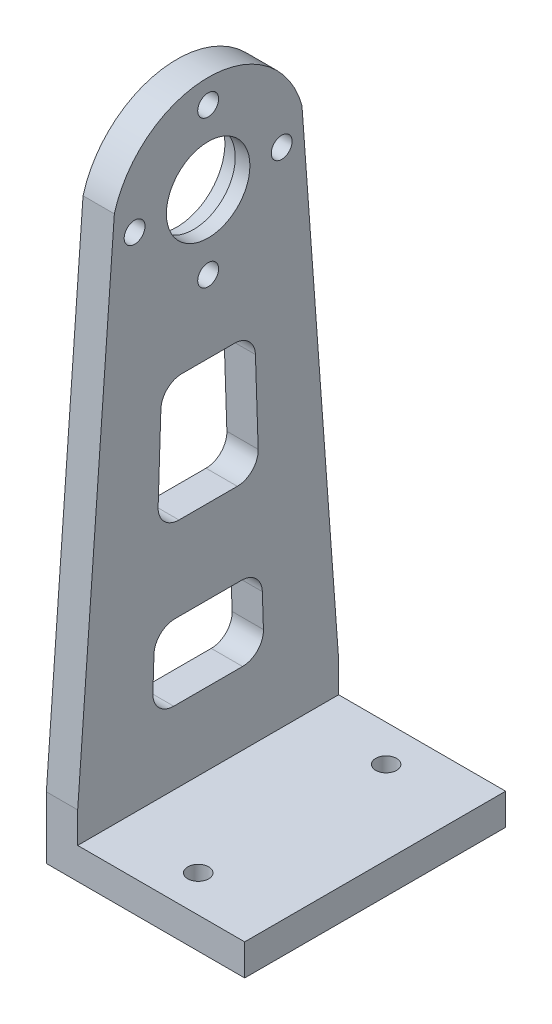
ISO-10303-21;
HEADER;
FILE_DESCRIPTION(('STEP AP214'),'2;1');
FILE_NAME('part.step','',(''),(''),'','','');
FILE_SCHEMA(('AUTOMOTIVE_DESIGN { 1 0 10303 214 1 1 1 1 }'));
ENDSEC;
DATA;
#1=APPLICATION_CONTEXT('core data for automotive mechanical design processes');
#2=APPLICATION_PROTOCOL_DEFINITION('international standard','automotive_design',2000,#1);
#3=PRODUCT_CONTEXT('',#1,'mechanical');
#4=PRODUCT('Part','Part','',(#3));
#5=PRODUCT_RELATED_PRODUCT_CATEGORY('part','',(#4));
#6=PRODUCT_DEFINITION_FORMATION('','',#4);
#7=PRODUCT_DEFINITION_CONTEXT('part definition',#1,'design');
#8=PRODUCT_DEFINITION('design','',#6,#7);
#9=PRODUCT_DEFINITION_SHAPE('','',#8);
#10=(LENGTH_UNIT() NAMED_UNIT(*) SI_UNIT(.MILLI.,.METRE.));
#11=(NAMED_UNIT(*) PLANE_ANGLE_UNIT() SI_UNIT($,.RADIAN.));
#12=(NAMED_UNIT(*) SI_UNIT($,.STERADIAN.) SOLID_ANGLE_UNIT());
#13=UNCERTAINTY_MEASURE_WITH_UNIT(LENGTH_MEASURE(1.E-05),#10,'distance_accuracy_value','');
#14=(GEOMETRIC_REPRESENTATION_CONTEXT(3) GLOBAL_UNCERTAINTY_ASSIGNED_CONTEXT((#13)) GLOBAL_UNIT_ASSIGNED_CONTEXT((#10,
#11,#12)) REPRESENTATION_CONTEXT('',''));
#15=CARTESIAN_POINT('',(0.,0.,0.));
#16=DIRECTION('',(0.,0.,1.));
#17=DIRECTION('',(1.,0.,0.));
#18=AXIS2_PLACEMENT_3D('',#15,#16,#17);
#19=CARTESIAN_POINT('',(15.5,-52.,0.));
#20=DIRECTION('',(-1.,0.,0.));
#21=DIRECTION('',(0.,0.,1.));
#22=AXIS2_PLACEMENT_3D('',#19,#20,#21);
#23=CYLINDRICAL_SURFACE('',#22,4.);
#24=CARTESIAN_POINT('',(16.5,-52.,0.));
#25=DIRECTION('',(-1.,0.,0.));
#26=DIRECTION('',(0.,0.,-1.));
#27=AXIS2_PLACEMENT_3D('',#24,#25,#26);
#28=CIRCLE('',#27,4.);
#29=CARTESIAN_POINT('',(16.5,-52.,-4.));
#30=VERTEX_POINT('',#29);
#31=EDGE_CURVE('E49',#30,#30,#28,.T.);
#32=ORIENTED_EDGE('',*,*,#31,.F.);
#33=EDGE_LOOP('',(#32));
#34=FACE_BOUND('',#33,.T.);
#35=CARTESIAN_POINT('',(15.1,-52.,0.));
#36=DIRECTION('',(-1.,0.,0.));
#37=DIRECTION('',(0.,0.,1.));
#38=AXIS2_PLACEMENT_3D('',#35,#36,#37);
#39=CIRCLE('',#38,4.);
#40=CARTESIAN_POINT('',(15.1,-52.,4.));
#41=VERTEX_POINT('',#40);
#42=EDGE_CURVE('E43',#41,#41,#39,.F.);
#43=ORIENTED_EDGE('',*,*,#42,.F.);
#44=EDGE_LOOP('',(#43));
#45=FACE_BOUND('',#44,.T.);
#46=ADVANCED_FACE('F40',(#34,#45),#23,.F.);
#47=CARTESIAN_POINT('',(16.5,-100.7,-12.5));
#48=DIRECTION('',(1.,0.,0.));
#49=DIRECTION('',(0.,-1.,0.));
#50=AXIS2_PLACEMENT_3D('',#47,#48,#49);
#51=PLANE('',#50);
#52=CARTESIAN_POINT('',(16.5,-59.0452123011725,1.54223501579341E-13));
#53=DIRECTION('',(-1.,0.,0.));
#54=DIRECTION('',(0.,0.,1.));
#55=AXIS2_PLACEMENT_3D('',#52,#53,#54);
#56=CIRCLE('',#55,1.);
#57=CARTESIAN_POINT('',(16.5,-59.0452123011725,1.00000000000015));
#58=VERTEX_POINT('',#57);
#59=EDGE_CURVE('E522',#58,#58,#56,.T.);
#60=ORIENTED_EDGE('',*,*,#59,.T.);
#61=EDGE_LOOP('',(#60));
#62=FACE_BOUND('',#61,.T.);
#63=CARTESIAN_POINT('',(16.5,-52.,7.04521230117253));
#64=DIRECTION('',(-1.,0.,0.));
#65=DIRECTION('',(0.,0.,1.));
#66=AXIS2_PLACEMENT_3D('',#63,#64,#65);
#67=CIRCLE('',#66,1.00000000000001);
#68=CARTESIAN_POINT('',(16.5,-52.,8.04521230117253));
#69=VERTEX_POINT('',#68);
#70=EDGE_CURVE('E528',#69,#69,#67,.T.);
#71=ORIENTED_EDGE('',*,*,#70,.T.);
#72=EDGE_LOOP('',(#71));
#73=FACE_BOUND('',#72,.T.);
#74=CARTESIAN_POINT('',(16.5,-52.0000000000001,-7.04521230117231));
#75=DIRECTION('',(-1.,0.,0.));
#76=DIRECTION('',(0.,0.,1.));
#77=AXIS2_PLACEMENT_3D('',#74,#75,#76);
#78=CIRCLE('',#77,1.);
#79=CARTESIAN_POINT('',(16.5,-52.0000000000001,-6.04521230117231));
#80=VERTEX_POINT('',#79);
#81=EDGE_CURVE('E534',#80,#80,#78,.T.);
#82=ORIENTED_EDGE('',*,*,#81,.T.);
#83=EDGE_LOOP('',(#82));
#84=FACE_BOUND('',#83,.T.);
#85=CARTESIAN_POINT('',(16.5,-44.9547876988277,0.));
#86=DIRECTION('',(-1.,0.,0.));
#87=DIRECTION('',(0.,0.,1.));
#88=AXIS2_PLACEMENT_3D('',#85,#86,#87);
#89=CIRCLE('',#88,1.);
#90=CARTESIAN_POINT('',(16.5,-44.9547876988277,1.00000000000001));
#91=VERTEX_POINT('',#90);
#92=EDGE_CURVE('E199',#91,#91,#89,.T.);
#93=ORIENTED_EDGE('',*,*,#92,.T.);
#94=EDGE_LOOP('',(#93));
#95=FACE_BOUND('',#94,.T.);
#96=DIRECTION('',(0.,-0.997297605701587,-0.0734675823876265));
#97=VECTOR('',#96,1.);
#98=CARTESIAN_POINT('',(16.5,-100.681108800183,-12.7564416540415));
#99=LINE('',#98,#97);
#100=CARTESIAN_POINT('',(16.5,-49.5,-8.986100377806));
#101=VERTEX_POINT('',#100);
#102=CARTESIAN_POINT('',(16.5,-97.2,-12.5));
#103=VERTEX_POINT('',#102);
#104=EDGE_CURVE('E174',#101,#103,#99,.T.);
#105=ORIENTED_EDGE('',*,*,#104,.F.);
#106=CARTESIAN_POINT('',(16.5,-52.0000000000001,0.));
#107=DIRECTION('',(1.,0.,0.));
#108=DIRECTION('',(0.,0.,-1.));
#109=AXIS2_PLACEMENT_3D('',#106,#107,#108);
#110=CIRCLE('',#109,9.32737905308911);
#111=CARTESIAN_POINT('',(16.5,-49.5,8.986100377806));
#112=VERTEX_POINT('',#111);
#113=EDGE_CURVE('E189',#101,#112,#110,.T.);
#114=ORIENTED_EDGE('',*,*,#113,.T.);
#115=DIRECTION('',(0.,0.997297605701587,-0.0734675823876265));
#116=VECTOR('',#115,1.);
#117=CARTESIAN_POINT('',(16.5,-98.8493826998868,12.6215045124945));
#118=LINE('',#117,#116);
#119=CARTESIAN_POINT('',(16.5,-97.2,12.5));
#120=VERTEX_POINT('',#119);
#121=EDGE_CURVE('E194',#120,#112,#118,.T.);
#122=ORIENTED_EDGE('',*,*,#121,.F.);
#123=DIRECTION('',(0.,1.,0.));
#124=VECTOR('',#123,1.);
#125=CARTESIAN_POINT('',(16.5,-100.7,12.5));
#126=LINE('',#125,#124);
#127=CARTESIAN_POINT('',(16.5,-100.149489742783,12.5));
#128=VERTEX_POINT('',#127);
#129=EDGE_CURVE('E154',#128,#120,#126,.T.);
#130=ORIENTED_EDGE('',*,*,#129,.F.);
#131=DIRECTION('',(0.,0.,1.));
#132=VECTOR('',#131,1.);
#133=CARTESIAN_POINT('',(16.5,-100.149489742783,12.5));
#134=LINE('',#133,#132);
#135=CARTESIAN_POINT('',(16.5,-100.149489742783,-12.5));
#136=VERTEX_POINT('',#135);
#137=EDGE_CURVE('E193',#136,#128,#134,.T.);
#138=ORIENTED_EDGE('',*,*,#137,.F.);
#139=DIRECTION('',(0.,1.,0.));
#140=VECTOR('',#139,1.);
#141=CARTESIAN_POINT('',(16.5,-100.7,-12.5));
#142=LINE('',#141,#140);
#143=EDGE_CURVE('E11',#136,#103,#142,.T.);
#144=ORIENTED_EDGE('',*,*,#143,.T.);
#145=EDGE_LOOP('',(#105,#114,#122,#130,#138,#144));
#146=FACE_BOUND('',#145,.T.);
#147=ORIENTED_EDGE('',*,*,#31,.T.);
#148=EDGE_LOOP('',(#147));
#149=FACE_BOUND('',#148,.T.);
#150=CARTESIAN_POINT('',(16.5,-91.2,-3.296767463509));
#151=DIRECTION('',(-1.,0.,0.));
#152=DIRECTION('',(0.,0.0330349000935773,-0.999454198738395));
#153=AXIS2_PLACEMENT_3D('',#150,#151,#152);
#154=CIRCLE('',#153,2.);
#155=CARTESIAN_POINT('',(16.5,-91.13393019981,-5.295675860986));
#156=VERTEX_POINT('',#155);
#157=CARTESIAN_POINT('',(16.5,-93.2,-3.296767463509));
#158=VERTEX_POINT('',#157);
#159=EDGE_CURVE('E261',#156,#158,#154,.T.);
#160=ORIENTED_EDGE('',*,*,#159,.T.);
#161=DIRECTION('',(0.,0.,-1.));
#162=VECTOR('',#161,1.);
#163=CARTESIAN_POINT('',(16.5,-93.2,3.296767463509));
#164=LINE('',#163,#162);
#165=CARTESIAN_POINT('',(16.5,-93.2,3.296767463509));
#166=VERTEX_POINT('',#165);
#167=EDGE_CURVE('E136',#166,#158,#164,.T.);
#168=ORIENTED_EDGE('',*,*,#167,.F.);
#169=CARTESIAN_POINT('',(16.5,-91.2,3.296767463509));
#170=DIRECTION('',(-1.,0.,0.));
#171=DIRECTION('',(0.,-1.,0.));
#172=AXIS2_PLACEMENT_3D('',#169,#170,#171);
#173=CIRCLE('',#172,2.);
#174=CARTESIAN_POINT('',(16.5,-91.13393019981,5.295675860986));
#175=VERTEX_POINT('',#174);
#176=EDGE_CURVE('E267',#166,#175,#173,.T.);
#177=ORIENTED_EDGE('',*,*,#176,.T.);
#178=DIRECTION('',(0.,-0.999454198738395,0.0330349000935798));
#179=VECTOR('',#178,1.);
#180=CARTESIAN_POINT('',(16.5,-87.93393019981,5.189906451609));
#181=LINE('',#180,#179);
#182=CARTESIAN_POINT('',(16.5,-87.93393019981,5.189906451609));
#183=VERTEX_POINT('',#182);
#184=EDGE_CURVE('E147',#183,#175,#181,.T.);
#185=ORIENTED_EDGE('',*,*,#184,.F.);
#186=CARTESIAN_POINT('',(16.5,-88.,3.190998054133));
#187=DIRECTION('',(-1.,0.,0.));
#188=DIRECTION('',(0.,0.0330349000935773,0.999454198738395));
#189=AXIS2_PLACEMENT_3D('',#186,#187,#188);
#190=CIRCLE('',#189,2.);
#191=CARTESIAN_POINT('',(16.5,-86.,3.190998054133));
#192=VERTEX_POINT('',#191);
#193=EDGE_CURVE('E128',#183,#192,#190,.T.);
#194=ORIENTED_EDGE('',*,*,#193,.T.);
#195=DIRECTION('',(0.,0.,1.));
#196=VECTOR('',#195,1.);
#197=CARTESIAN_POINT('',(16.5,-86.,-3.190998054133));
#198=LINE('',#197,#196);
#199=CARTESIAN_POINT('',(16.5,-86.,-3.190998054133));
#200=VERTEX_POINT('',#199);
#201=EDGE_CURVE('E103',#200,#192,#198,.T.);
#202=ORIENTED_EDGE('',*,*,#201,.F.);
#203=CARTESIAN_POINT('',(16.5,-88.,-3.190998054133));
#204=DIRECTION('',(-1.,0.,0.));
#205=DIRECTION('',(0.,1.,0.));
#206=AXIS2_PLACEMENT_3D('',#203,#204,#205);
#207=CIRCLE('',#206,2.);
#208=CARTESIAN_POINT('',(16.5,-87.93393019981,-5.189906451609));
#209=VERTEX_POINT('',#208);
#210=EDGE_CURVE('E122',#200,#209,#207,.T.);
#211=ORIENTED_EDGE('',*,*,#210,.T.);
#212=DIRECTION('',(0.,0.999454198738395,0.0330349000935798));
#213=VECTOR('',#212,1.);
#214=CARTESIAN_POINT('',(16.5,-91.13393019981,-5.295675860986));
#215=LINE('',#214,#213);
#216=EDGE_CURVE('E109',#156,#209,#215,.T.);
#217=ORIENTED_EDGE('',*,*,#216,.F.);
#218=EDGE_LOOP('',(#160,#168,#177,#185,#194,#202,#211,#217));
#219=FACE_BOUND('',#218,.T.);
#220=CARTESIAN_POINT('',(16.5,-68.,-2.529939245529));
#221=DIRECTION('',(-1.,0.,0.));
#222=DIRECTION('',(0.,1.,0.));
#223=AXIS2_PLACEMENT_3D('',#220,#221,#222);
#224=CIRCLE('',#223,2.);
#225=CARTESIAN_POINT('',(16.5,-66.,-2.529939245529));
#226=VERTEX_POINT('',#225);
#227=CARTESIAN_POINT('',(16.5,-67.93393019981,-4.528847643006));
#228=VERTEX_POINT('',#227);
#229=EDGE_CURVE('E241',#226,#228,#224,.T.);
#230=ORIENTED_EDGE('',*,*,#229,.T.);
#231=DIRECTION('',(0.,0.999454198738395,0.0330349000935798));
#232=VECTOR('',#231,1.);
#233=CARTESIAN_POINT('',(16.5,-75.93393019981,-4.793271166447));
#234=LINE('',#233,#232);
#235=CARTESIAN_POINT('',(16.5,-75.93393019981,-4.793271166447));
#236=VERTEX_POINT('',#235);
#237=EDGE_CURVE('E58',#236,#228,#234,.T.);
#238=ORIENTED_EDGE('',*,*,#237,.F.);
#239=CARTESIAN_POINT('',(16.5,-76.,-2.794362768971));
#240=DIRECTION('',(-1.,0.,0.));
#241=DIRECTION('',(0.,0.0330349000935773,-0.999454198738395));
#242=AXIS2_PLACEMENT_3D('',#239,#240,#241);
#243=CIRCLE('',#242,2.);
#244=CARTESIAN_POINT('',(16.5,-78.,-2.794362768971));
#245=VERTEX_POINT('',#244);
#246=EDGE_CURVE('E243',#236,#245,#243,.T.);
#247=ORIENTED_EDGE('',*,*,#246,.T.);
#248=DIRECTION('',(0.,0.,-1.));
#249=VECTOR('',#248,1.);
#250=CARTESIAN_POINT('',(16.5,-78.,2.794362768971));
#251=LINE('',#250,#249);
#252=CARTESIAN_POINT('',(16.5,-78.,2.794362768971));
#253=VERTEX_POINT('',#252);
#254=EDGE_CURVE('E250',#253,#245,#251,.T.);
#255=ORIENTED_EDGE('',*,*,#254,.F.);
#256=CARTESIAN_POINT('',(16.5,-76.,2.794362768971));
#257=DIRECTION('',(-1.,0.,0.));
#258=DIRECTION('',(0.,-1.,0.));
#259=AXIS2_PLACEMENT_3D('',#256,#257,#258);
#260=CIRCLE('',#259,2.);
#261=CARTESIAN_POINT('',(16.5,-75.93393019981,4.793271166447));
#262=VERTEX_POINT('',#261);
#263=EDGE_CURVE('E249',#253,#262,#260,.T.);
#264=ORIENTED_EDGE('',*,*,#263,.T.);
#265=DIRECTION('',(0.,-0.999454198738395,0.0330349000935798));
#266=VECTOR('',#265,1.);
#267=CARTESIAN_POINT('',(16.5,-67.93393019981,4.528847643006));
#268=LINE('',#267,#266);
#269=CARTESIAN_POINT('',(16.5,-67.93393019981,4.528847643006));
#270=VERTEX_POINT('',#269);
#271=EDGE_CURVE('E129',#270,#262,#268,.T.);
#272=ORIENTED_EDGE('',*,*,#271,.F.);
#273=CARTESIAN_POINT('',(16.5,-68.,2.529939245529));
#274=DIRECTION('',(-1.,0.,0.));
#275=DIRECTION('',(0.,0.0330349000935773,0.999454198738395));
#276=AXIS2_PLACEMENT_3D('',#273,#274,#275);
#277=CIRCLE('',#276,2.);
#278=CARTESIAN_POINT('',(16.5,-66.,2.529939245529));
#279=VERTEX_POINT('',#278);
#280=EDGE_CURVE('E256',#270,#279,#277,.T.);
#281=ORIENTED_EDGE('',*,*,#280,.T.);
#282=DIRECTION('',(0.,0.,1.));
#283=VECTOR('',#282,1.);
#284=CARTESIAN_POINT('',(16.5,-66.,-2.529939245529));
#285=LINE('',#284,#283);
#286=EDGE_CURVE('E262',#226,#279,#285,.T.);
#287=ORIENTED_EDGE('',*,*,#286,.F.);
#288=EDGE_LOOP('',(#230,#238,#247,#255,#264,#272,#281,#287));
#289=FACE_BOUND('',#288,.T.);
#290=ADVANCED_FACE('F123',(#62,#73,#84,#95,#146,#149,#219,#289),#51,.T.);
#291=CARTESIAN_POINT('',(15.5,-70.85,12.5));
#292=DIRECTION('',(0.,0.,-1.));
#293=DIRECTION('',(0.,-1.,0.));
#294=AXIS2_PLACEMENT_3D('',#291,#292,#293);
#295=PLANE('',#294);
#296=DIRECTION('',(-1.,0.,0.));
#297=VECTOR('',#296,1.);
#298=CARTESIAN_POINT('',(32.5,-100.149489742783,12.5));
#299=LINE('',#298,#297);
#300=CARTESIAN_POINT('',(32.5,-100.149489742783,12.5));
#301=VERTEX_POINT('',#300);
#302=EDGE_CURVE('E224',#301,#128,#299,.T.);
#303=ORIENTED_EDGE('',*,*,#302,.T.);
#304=ORIENTED_EDGE('',*,*,#129,.T.);
#305=DIRECTION('',(-1.,0.,0.));
#306=VECTOR('',#305,1.);
#307=CARTESIAN_POINT('',(16.5,-97.2,12.5));
#308=LINE('',#307,#306);
#309=CARTESIAN_POINT('',(13.5,-97.2,12.5));
#310=VERTEX_POINT('',#309);
#311=EDGE_CURVE('E160',#120,#310,#308,.T.);
#312=ORIENTED_EDGE('',*,*,#311,.T.);
#313=DIRECTION('',(0.,-1.,0.));
#314=VECTOR('',#313,1.);
#315=CARTESIAN_POINT('',(13.5,0.,12.5));
#316=LINE('',#315,#314);
#317=CARTESIAN_POINT('',(13.5,-103.149489742783,12.5));
#318=VERTEX_POINT('',#317);
#319=EDGE_CURVE('E386',#310,#318,#316,.T.);
#320=ORIENTED_EDGE('',*,*,#319,.T.);
#321=DIRECTION('',(-1.,0.,0.));
#322=VECTOR('',#321,1.);
#323=CARTESIAN_POINT('',(75.6884089130718,-103.149489742783,12.5));
#324=LINE('',#323,#322);
#325=CARTESIAN_POINT('',(32.5,-103.149489742783,12.5));
#326=VERTEX_POINT('',#325);
#327=EDGE_CURVE('E232',#326,#318,#324,.T.);
#328=ORIENTED_EDGE('',*,*,#327,.F.);
#329=DIRECTION('',(0.,-1.,0.));
#330=VECTOR('',#329,1.);
#331=CARTESIAN_POINT('',(32.5,-103.149489742783,12.5));
#332=LINE('',#331,#330);
#333=EDGE_CURVE('E212',#301,#326,#332,.T.);
#334=ORIENTED_EDGE('',*,*,#333,.F.);
#335=EDGE_LOOP('',(#303,#304,#312,#320,#328,#334));
#336=FACE_BOUND('',#335,.T.);
#337=ADVANCED_FACE('F377',(#336),#295,.F.);
#338=CARTESIAN_POINT('',(15.93933982822,-101.76066017178,-12.5));
#339=DIRECTION('',(0.,0.,-1.));
#340=DIRECTION('',(1.,0.,0.));
#341=AXIS2_PLACEMENT_3D('',#338,#339,#340);
#342=PLANE('',#341);
#343=DIRECTION('',(-1.,0.,0.));
#344=VECTOR('',#343,1.);
#345=CARTESIAN_POINT('',(75.6884089130718,-103.149489742783,-12.5));
#346=LINE('',#345,#344);
#347=CARTESIAN_POINT('',(32.5,-103.149489742783,-12.5));
#348=VERTEX_POINT('',#347);
#349=CARTESIAN_POINT('',(13.5,-103.149489742783,-12.5));
#350=VERTEX_POINT('',#349);
#351=EDGE_CURVE('E159',#348,#350,#346,.T.);
#352=ORIENTED_EDGE('',*,*,#351,.T.);
#353=DIRECTION('',(0.,1.,0.));
#354=VECTOR('',#353,1.);
#355=CARTESIAN_POINT('',(13.5,0.,-12.5));
#356=LINE('',#355,#354);
#357=CARTESIAN_POINT('',(13.5,-97.2,-12.5));
#358=VERTEX_POINT('',#357);
#359=EDGE_CURVE('E394',#350,#358,#356,.T.);
#360=ORIENTED_EDGE('',*,*,#359,.T.);
#361=DIRECTION('',(-1.,0.,0.));
#362=VECTOR('',#361,1.);
#363=CARTESIAN_POINT('',(16.5,-97.2,-12.5));
#364=LINE('',#363,#362);
#365=EDGE_CURVE('E163',#103,#358,#364,.T.);
#366=ORIENTED_EDGE('',*,*,#365,.F.);
#367=ORIENTED_EDGE('',*,*,#143,.F.);
#368=DIRECTION('',(-1.,0.,0.));
#369=VECTOR('',#368,1.);
#370=CARTESIAN_POINT('',(32.5,-100.149489742783,-12.5));
#371=LINE('',#370,#369);
#372=CARTESIAN_POINT('',(32.5,-100.149489742783,-12.5));
#373=VERTEX_POINT('',#372);
#374=EDGE_CURVE('E229',#373,#136,#371,.T.);
#375=ORIENTED_EDGE('',*,*,#374,.F.);
#376=DIRECTION('',(0.,1.,0.));
#377=VECTOR('',#376,1.);
#378=CARTESIAN_POINT('',(32.5,-100.149489742783,-12.5));
#379=LINE('',#378,#377);
#380=EDGE_CURVE('E218',#348,#373,#379,.T.);
#381=ORIENTED_EDGE('',*,*,#380,.F.);
#382=EDGE_LOOP('',(#352,#360,#366,#367,#375,#381));
#383=FACE_BOUND('',#382,.T.);
#384=ADVANCED_FACE('F479',(#383),#342,.T.);
#385=CARTESIAN_POINT('',(15.5,-72.,4.663243205897));
#386=DIRECTION('',(0.,0.0330349000935798,0.999454198738395));
#387=DIRECTION('',(0.,0.999454198738395,-0.0330349000935798));
#388=AXIS2_PLACEMENT_3D('',#385,#386,#387);
#389=PLANE('',#388);
#390=ORIENTED_EDGE('',*,*,#271,.T.);
#391=DIRECTION('',(-1.,0.,0.));
#392=VECTOR('',#391,1.);
#393=CARTESIAN_POINT('',(16.5,-75.93393019981,4.793271166447));
#394=LINE('',#393,#392);
#395=CARTESIAN_POINT('',(13.5,-75.93393019981,4.79327116644733));
#396=VERTEX_POINT('',#395);
#397=EDGE_CURVE('E258',#262,#396,#394,.T.);
#398=ORIENTED_EDGE('',*,*,#397,.T.);
#399=DIRECTION('',(0.,0.999454198738395,-0.0330349000935798));
#400=VECTOR('',#399,1.);
#401=CARTESIAN_POINT('',(13.5,0.0753917599162948,2.28093957557516));
#402=LINE('',#401,#400);
#403=CARTESIAN_POINT('',(13.5,-67.93393019981,4.5288476430057));
#404=VERTEX_POINT('',#403);
#405=EDGE_CURVE('E329',#396,#404,#402,.T.);
#406=ORIENTED_EDGE('',*,*,#405,.T.);
#407=DIRECTION('',(-1.,0.,0.));
#408=VECTOR('',#407,1.);
#409=CARTESIAN_POINT('',(16.5,-67.93393019981,4.528847643006));
#410=LINE('',#409,#408);
#411=EDGE_CURVE('E264',#270,#404,#410,.T.);
#412=ORIENTED_EDGE('',*,*,#411,.F.);
#413=EDGE_LOOP('',(#390,#398,#406,#412));
#414=FACE_BOUND('',#413,.T.);
#415=ADVANCED_FACE('F477',(#414),#389,.F.);
#416=CARTESIAN_POINT('',(118.162,-68.,2.529939245529));
#417=DIRECTION('',(-1.,0.,0.));
#418=DIRECTION('',(0.,-0.0330349000935773,-0.999454198738395));
#419=AXIS2_PLACEMENT_3D('',#416,#417,#418);
#420=CYLINDRICAL_SURFACE('',#419,2.);
#421=ORIENTED_EDGE('',*,*,#411,.T.);
#422=CARTESIAN_POINT('',(13.5,-68.,2.529939245529));
#423=DIRECTION('',(1.,0.,0.));
#424=DIRECTION('',(0.,0.,-1.));
#425=AXIS2_PLACEMENT_3D('',#422,#423,#424);
#426=CIRCLE('',#425,2.);
#427=CARTESIAN_POINT('',(13.5,-66.,2.529939245529));
#428=VERTEX_POINT('',#427);
#429=EDGE_CURVE('E208',#404,#428,#426,.F.);
#430=ORIENTED_EDGE('',*,*,#429,.T.);
#431=DIRECTION('',(-1.,0.,0.));
#432=VECTOR('',#431,1.);
#433=CARTESIAN_POINT('',(16.5,-66.,2.529939245529));
#434=LINE('',#433,#432);
#435=EDGE_CURVE('E265',#279,#428,#434,.T.);
#436=ORIENTED_EDGE('',*,*,#435,.F.);
#437=ORIENTED_EDGE('',*,*,#280,.F.);
#438=EDGE_LOOP('',(#421,#430,#436,#437));
#439=FACE_BOUND('',#438,.T.);
#440=ADVANCED_FACE('F340',(#439),#420,.F.);
#441=CARTESIAN_POINT('',(15.5,-66.,0.));
#442=DIRECTION('',(0.,1.,0.));
#443=DIRECTION('',(0.,0.,-1.));
#444=AXIS2_PLACEMENT_3D('',#441,#442,#443);
#445=PLANE('',#444);
#446=ORIENTED_EDGE('',*,*,#286,.T.);
#447=ORIENTED_EDGE('',*,*,#435,.T.);
#448=DIRECTION('',(0.,0.,-1.));
#449=VECTOR('',#448,1.);
#450=CARTESIAN_POINT('',(13.5,-66.,0.));
#451=LINE('',#450,#449);
#452=CARTESIAN_POINT('',(13.5,-66.,-2.529939245529));
#453=VERTEX_POINT('',#452);
#454=EDGE_CURVE('E309',#428,#453,#451,.T.);
#455=ORIENTED_EDGE('',*,*,#454,.T.);
#456=DIRECTION('',(-1.,0.,0.));
#457=VECTOR('',#456,1.);
#458=CARTESIAN_POINT('',(16.5,-66.,-2.529939245529));
#459=LINE('',#458,#457);
#460=EDGE_CURVE('E245',#226,#453,#459,.T.);
#461=ORIENTED_EDGE('',*,*,#460,.F.);
#462=EDGE_LOOP('',(#446,#447,#455,#461));
#463=FACE_BOUND('',#462,.T.);
#464=ADVANCED_FACE('F475',(#463),#445,.F.);
#465=CARTESIAN_POINT('',(118.162,-68.,-2.529939245529));
#466=DIRECTION('',(-1.,0.,0.));
#467=DIRECTION('',(0.,-1.,0.));
#468=AXIS2_PLACEMENT_3D('',#465,#466,#467);
#469=CYLINDRICAL_SURFACE('',#468,2.);
#470=ORIENTED_EDGE('',*,*,#460,.T.);
#471=CARTESIAN_POINT('',(13.5,-68.,-2.529939245529));
#472=DIRECTION('',(1.,0.,0.));
#473=DIRECTION('',(0.,0.,-1.));
#474=AXIS2_PLACEMENT_3D('',#471,#472,#473);
#475=CIRCLE('',#474,2.);
#476=CARTESIAN_POINT('',(13.5,-67.93393019981,-4.52884764300567));
#477=VERTEX_POINT('',#476);
#478=EDGE_CURVE('E312',#453,#477,#475,.F.);
#479=ORIENTED_EDGE('',*,*,#478,.T.);
#480=DIRECTION('',(-1.,0.,0.));
#481=VECTOR('',#480,1.);
#482=CARTESIAN_POINT('',(16.5,-67.93393019981,-4.528847643006));
#483=LINE('',#482,#481);
#484=EDGE_CURVE('E246',#228,#477,#483,.T.);
#485=ORIENTED_EDGE('',*,*,#484,.F.);
#486=ORIENTED_EDGE('',*,*,#229,.F.);
#487=EDGE_LOOP('',(#470,#479,#485,#486));
#488=FACE_BOUND('',#487,.T.);
#489=ADVANCED_FACE('F472',(#488),#469,.F.);
#490=CARTESIAN_POINT('',(15.5,-72.,-4.663243205897));
#491=DIRECTION('',(0.,0.0330349000935798,-0.999454198738395));
#492=DIRECTION('',(0.,-0.999454198738395,-0.0330349000935798));
#493=AXIS2_PLACEMENT_3D('',#490,#491,#492);
#494=PLANE('',#493);
#495=ORIENTED_EDGE('',*,*,#484,.T.);
#496=DIRECTION('',(0.,-0.999454198738395,-0.0330349000935798));
#497=VECTOR('',#496,1.);
#498=CARTESIAN_POINT('',(13.5,0.0753917599162838,-2.28093957557483));
#499=LINE('',#498,#497);
#500=CARTESIAN_POINT('',(13.5,-75.9339301998128,-4.79327116644779));
#501=VERTEX_POINT('',#500);
#502=EDGE_CURVE('E318',#477,#501,#499,.T.);
#503=ORIENTED_EDGE('',*,*,#502,.T.);
#504=DIRECTION('',(-1.,0.,0.));
#505=VECTOR('',#504,1.);
#506=CARTESIAN_POINT('',(16.5,-75.93393019981,-4.793271166447));
#507=LINE('',#506,#505);
#508=EDGE_CURVE('E252',#236,#501,#507,.T.);
#509=ORIENTED_EDGE('',*,*,#508,.F.);
#510=ORIENTED_EDGE('',*,*,#237,.T.);
#511=EDGE_LOOP('',(#495,#503,#509,#510));
#512=FACE_BOUND('',#511,.T.);
#513=ADVANCED_FACE('F468',(#512),#494,.F.);
#514=CARTESIAN_POINT('',(118.162,-76.,-2.794362768971));
#515=DIRECTION('',(-1.,0.,0.));
#516=DIRECTION('',(0.,-0.0330349000935773,0.999454198738395));
#517=AXIS2_PLACEMENT_3D('',#514,#515,#516);
#518=CYLINDRICAL_SURFACE('',#517,2.);
#519=ORIENTED_EDGE('',*,*,#508,.T.);
#520=CARTESIAN_POINT('',(13.5,-76.,-2.794362768971));
#521=DIRECTION('',(1.,0.,0.));
#522=DIRECTION('',(0.,0.,-1.));
#523=AXIS2_PLACEMENT_3D('',#520,#521,#522);
#524=CIRCLE('',#523,2.);
#525=CARTESIAN_POINT('',(13.5,-78.,-2.794362768971));
#526=VERTEX_POINT('',#525);
#527=EDGE_CURVE('E321',#501,#526,#524,.F.);
#528=ORIENTED_EDGE('',*,*,#527,.T.);
#529=DIRECTION('',(-1.,0.,0.));
#530=VECTOR('',#529,1.);
#531=CARTESIAN_POINT('',(16.5,-78.,-2.794362768971));
#532=LINE('',#531,#530);
#533=EDGE_CURVE('E253',#245,#526,#532,.T.);
#534=ORIENTED_EDGE('',*,*,#533,.F.);
#535=ORIENTED_EDGE('',*,*,#246,.F.);
#536=EDGE_LOOP('',(#519,#528,#534,#535));
#537=FACE_BOUND('',#536,.T.);
#538=ADVANCED_FACE('F466',(#537),#518,.F.);
#539=CARTESIAN_POINT('',(15.5,-78.,0.));
#540=DIRECTION('',(0.,-1.,0.));
#541=DIRECTION('',(0.,0.,1.));
#542=AXIS2_PLACEMENT_3D('',#539,#540,#541);
#543=PLANE('',#542);
#544=ORIENTED_EDGE('',*,*,#254,.T.);
#545=ORIENTED_EDGE('',*,*,#533,.T.);
#546=DIRECTION('',(0.,0.,1.));
#547=VECTOR('',#546,1.);
#548=CARTESIAN_POINT('',(13.5,-78.,0.));
#549=LINE('',#548,#547);
#550=CARTESIAN_POINT('',(13.5,-78.,2.794362768971));
#551=VERTEX_POINT('',#550);
#552=EDGE_CURVE('E324',#526,#551,#549,.T.);
#553=ORIENTED_EDGE('',*,*,#552,.T.);
#554=DIRECTION('',(-1.,0.,0.));
#555=VECTOR('',#554,1.);
#556=CARTESIAN_POINT('',(16.5,-78.,2.794362768971));
#557=LINE('',#556,#555);
#558=EDGE_CURVE('E273',#253,#551,#557,.T.);
#559=ORIENTED_EDGE('',*,*,#558,.F.);
#560=EDGE_LOOP('',(#544,#545,#553,#559));
#561=FACE_BOUND('',#560,.T.);
#562=ADVANCED_FACE('F462',(#561),#543,.F.);
#563=CARTESIAN_POINT('',(118.162,-76.,2.794362768971));
#564=DIRECTION('',(-1.,0.,0.));
#565=DIRECTION('',(0.,1.,0.));
#566=AXIS2_PLACEMENT_3D('',#563,#564,#565);
#567=CYLINDRICAL_SURFACE('',#566,2.);
#568=ORIENTED_EDGE('',*,*,#558,.T.);
#569=CARTESIAN_POINT('',(13.5,-76.,2.794362768971));
#570=DIRECTION('',(1.,0.,0.));
#571=DIRECTION('',(0.,0.,-1.));
#572=AXIS2_PLACEMENT_3D('',#569,#570,#571);
#573=CIRCLE('',#572,2.);
#574=EDGE_CURVE('E327',#551,#396,#573,.F.);
#575=ORIENTED_EDGE('',*,*,#574,.T.);
#576=ORIENTED_EDGE('',*,*,#397,.F.);
#577=ORIENTED_EDGE('',*,*,#263,.F.);
#578=EDGE_LOOP('',(#568,#575,#576,#577));
#579=FACE_BOUND('',#578,.T.);
#580=ADVANCED_FACE('F457',(#579),#567,.F.);
#581=CARTESIAN_POINT('',(15.5,-86.,0.));
#582=DIRECTION('',(0.,1.,0.));
#583=DIRECTION('',(0.,0.,-1.));
#584=AXIS2_PLACEMENT_3D('',#581,#582,#583);
#585=PLANE('',#584);
#586=ORIENTED_EDGE('',*,*,#201,.T.);
#587=DIRECTION('',(-1.,0.,0.));
#588=VECTOR('',#587,1.);
#589=CARTESIAN_POINT('',(16.5,-86.,3.190998054133));
#590=LINE('',#589,#588);
#591=CARTESIAN_POINT('',(13.5,-86.,3.190998054133));
#592=VERTEX_POINT('',#591);
#593=EDGE_CURVE('E274',#192,#592,#590,.T.);
#594=ORIENTED_EDGE('',*,*,#593,.T.);
#595=DIRECTION('',(0.,0.,-1.));
#596=VECTOR('',#595,1.);
#597=CARTESIAN_POINT('',(13.5,-86.,0.));
#598=LINE('',#597,#596);
#599=CARTESIAN_POINT('',(13.5,-86.,-3.190998054133));
#600=VERTEX_POINT('',#599);
#601=EDGE_CURVE('E298',#592,#600,#598,.T.);
#602=ORIENTED_EDGE('',*,*,#601,.T.);
#603=DIRECTION('',(-1.,0.,0.));
#604=VECTOR('',#603,1.);
#605=CARTESIAN_POINT('',(16.5,-86.,-3.190998054133));
#606=LINE('',#605,#604);
#607=EDGE_CURVE('E120',#200,#600,#606,.T.);
#608=ORIENTED_EDGE('',*,*,#607,.F.);
#609=EDGE_LOOP('',(#586,#594,#602,#608));
#610=FACE_BOUND('',#609,.T.);
#611=ADVANCED_FACE('F299',(#610),#585,.F.);
#612=CARTESIAN_POINT('',(118.162,-88.,-3.190998054133));
#613=DIRECTION('',(-1.,0.,0.));
#614=DIRECTION('',(0.,-1.,0.));
#615=AXIS2_PLACEMENT_3D('',#612,#613,#614);
#616=CYLINDRICAL_SURFACE('',#615,2.);
#617=ORIENTED_EDGE('',*,*,#607,.T.);
#618=CARTESIAN_POINT('',(13.5,-88.,-3.190998054133));
#619=DIRECTION('',(1.,0.,0.));
#620=DIRECTION('',(0.,0.,-1.));
#621=AXIS2_PLACEMENT_3D('',#618,#619,#620);
#622=CIRCLE('',#621,2.);
#623=CARTESIAN_POINT('',(13.5,-87.93393019981,-5.18990645160947));
#624=VERTEX_POINT('',#623);
#625=EDGE_CURVE('E134',#600,#624,#622,.F.);
#626=ORIENTED_EDGE('',*,*,#625,.T.);
#627=DIRECTION('',(-1.,0.,0.));
#628=VECTOR('',#627,1.);
#629=CARTESIAN_POINT('',(16.5,-87.93393019981,-5.189906451609));
#630=LINE('',#629,#628);
#631=EDGE_CURVE('E114',#209,#624,#630,.T.);
#632=ORIENTED_EDGE('',*,*,#631,.F.);
#633=ORIENTED_EDGE('',*,*,#210,.F.);
#634=EDGE_LOOP('',(#617,#626,#632,#633));
#635=FACE_BOUND('',#634,.T.);
#636=ADVANCED_FACE('F132',(#635),#616,.F.);
#637=CARTESIAN_POINT('',(15.5,-89.6,-5.244974957468));
#638=DIRECTION('',(0.,0.0330349000935798,-0.999454198738395));
#639=DIRECTION('',(0.,-0.999454198738395,-0.0330349000935798));
#640=AXIS2_PLACEMENT_3D('',#637,#638,#639);
#641=PLANE('',#640);
#642=ORIENTED_EDGE('',*,*,#631,.T.);
#643=DIRECTION('',(0.,-0.999454198738395,-0.0330349000935798));
#644=VECTOR('',#643,1.);
#645=CARTESIAN_POINT('',(13.5,0.0753917599162994,-2.2809395755753));
#646=LINE('',#645,#644);
#647=CARTESIAN_POINT('',(13.5,-91.13393019981,-5.295675860986));
#648=VERTEX_POINT('',#647);
#649=EDGE_CURVE('E308',#624,#648,#646,.T.);
#650=ORIENTED_EDGE('',*,*,#649,.T.);
#651=DIRECTION('',(-1.,0.,0.));
#652=VECTOR('',#651,1.);
#653=CARTESIAN_POINT('',(16.5,-91.13393019981,-5.295675860986));
#654=LINE('',#653,#652);
#655=EDGE_CURVE('E117',#156,#648,#654,.T.);
#656=ORIENTED_EDGE('',*,*,#655,.F.);
#657=ORIENTED_EDGE('',*,*,#216,.T.);
#658=EDGE_LOOP('',(#642,#650,#656,#657));
#659=FACE_BOUND('',#658,.T.);
#660=ADVANCED_FACE('F110',(#659),#641,.F.);
#661=CARTESIAN_POINT('',(118.162,-91.2,-3.296767463509));
#662=DIRECTION('',(-1.,0.,0.));
#663=DIRECTION('',(0.,-0.0330349000935773,0.999454198738395));
#664=AXIS2_PLACEMENT_3D('',#661,#662,#663);
#665=CYLINDRICAL_SURFACE('',#664,2.);
#666=ORIENTED_EDGE('',*,*,#655,.T.);
#667=CARTESIAN_POINT('',(13.5,-91.2,-3.296767463509));
#668=DIRECTION('',(1.,0.,0.));
#669=DIRECTION('',(0.,0.,-1.));
#670=AXIS2_PLACEMENT_3D('',#667,#668,#669);
#671=CIRCLE('',#670,2.);
#672=CARTESIAN_POINT('',(13.5,-93.2,-3.296767463509));
#673=VERTEX_POINT('',#672);
#674=EDGE_CURVE('E402',#648,#673,#671,.F.);
#675=ORIENTED_EDGE('',*,*,#674,.T.);
#676=DIRECTION('',(-1.,0.,0.));
#677=VECTOR('',#676,1.);
#678=CARTESIAN_POINT('',(16.5,-93.2,-3.296767463509));
#679=LINE('',#678,#677);
#680=EDGE_CURVE('E141',#158,#673,#679,.T.);
#681=ORIENTED_EDGE('',*,*,#680,.F.);
#682=ORIENTED_EDGE('',*,*,#159,.F.);
#683=EDGE_LOOP('',(#666,#675,#681,#682));
#684=FACE_BOUND('',#683,.T.);
#685=ADVANCED_FACE('F441',(#684),#665,.F.);
#686=CARTESIAN_POINT('',(15.5,-93.2,0.));
#687=DIRECTION('',(0.,-1.,0.));
#688=DIRECTION('',(0.,0.,1.));
#689=AXIS2_PLACEMENT_3D('',#686,#687,#688);
#690=PLANE('',#689);
#691=ORIENTED_EDGE('',*,*,#167,.T.);
#692=ORIENTED_EDGE('',*,*,#680,.T.);
#693=DIRECTION('',(0.,0.,1.));
#694=VECTOR('',#693,1.);
#695=CARTESIAN_POINT('',(13.5,-93.2,0.));
#696=LINE('',#695,#694);
#697=CARTESIAN_POINT('',(13.5,-93.2,3.296767463509));
#698=VERTEX_POINT('',#697);
#699=EDGE_CURVE('E405',#673,#698,#696,.T.);
#700=ORIENTED_EDGE('',*,*,#699,.T.);
#701=DIRECTION('',(-1.,0.,0.));
#702=VECTOR('',#701,1.);
#703=CARTESIAN_POINT('',(16.5,-93.2,3.296767463509));
#704=LINE('',#703,#702);
#705=EDGE_CURVE('E144',#166,#698,#704,.T.);
#706=ORIENTED_EDGE('',*,*,#705,.F.);
#707=EDGE_LOOP('',(#691,#692,#700,#706));
#708=FACE_BOUND('',#707,.T.);
#709=ADVANCED_FACE('F436',(#708),#690,.F.);
#710=CARTESIAN_POINT('',(118.162,-91.2,3.296767463509));
#711=DIRECTION('',(-1.,0.,0.));
#712=DIRECTION('',(0.,1.,0.));
#713=AXIS2_PLACEMENT_3D('',#710,#711,#712);
#714=CYLINDRICAL_SURFACE('',#713,2.);
#715=ORIENTED_EDGE('',*,*,#705,.T.);
#716=CARTESIAN_POINT('',(13.5,-91.2,3.296767463509));
#717=DIRECTION('',(1.,0.,0.));
#718=DIRECTION('',(0.,0.,-1.));
#719=AXIS2_PLACEMENT_3D('',#716,#717,#718);
#720=CIRCLE('',#719,2.);
#721=CARTESIAN_POINT('',(13.5,-91.13393019981,5.29567586098553));
#722=VERTEX_POINT('',#721);
#723=EDGE_CURVE('E408',#698,#722,#720,.F.);
#724=ORIENTED_EDGE('',*,*,#723,.T.);
#725=DIRECTION('',(-1.,0.,0.));
#726=VECTOR('',#725,1.);
#727=CARTESIAN_POINT('',(16.5,-91.13393019981,5.295675860986));
#728=LINE('',#727,#726);
#729=EDGE_CURVE('E148',#175,#722,#728,.T.);
#730=ORIENTED_EDGE('',*,*,#729,.F.);
#731=ORIENTED_EDGE('',*,*,#176,.F.);
#732=EDGE_LOOP('',(#715,#724,#730,#731));
#733=FACE_BOUND('',#732,.T.);
#734=ADVANCED_FACE('F430',(#733),#714,.F.);
#735=CARTESIAN_POINT('',(15.5,-89.6,5.244974957468));
#736=DIRECTION('',(0.,0.0330349000935798,0.999454198738395));
#737=DIRECTION('',(0.,0.999454198738395,-0.0330349000935798));
#738=AXIS2_PLACEMENT_3D('',#735,#736,#737);
#739=PLANE('',#738);
#740=ORIENTED_EDGE('',*,*,#184,.T.);
#741=ORIENTED_EDGE('',*,*,#729,.T.);
#742=DIRECTION('',(0.,0.999454198738395,-0.0330349000935798));
#743=VECTOR('',#742,1.);
#744=CARTESIAN_POINT('',(13.5,0.075391759916284,2.28093957557484));
#745=LINE('',#744,#743);
#746=CARTESIAN_POINT('',(13.5,-87.93393019981,5.1899064516097));
#747=VERTEX_POINT('',#746);
#748=EDGE_CURVE('E411',#722,#747,#745,.T.);
#749=ORIENTED_EDGE('',*,*,#748,.T.);
#750=DIRECTION('',(-1.,0.,0.));
#751=VECTOR('',#750,1.);
#752=CARTESIAN_POINT('',(16.5,-87.93393019981,5.189906451609));
#753=LINE('',#752,#751);
#754=EDGE_CURVE('E151',#183,#747,#753,.T.);
#755=ORIENTED_EDGE('',*,*,#754,.F.);
#756=EDGE_LOOP('',(#740,#741,#749,#755));
#757=FACE_BOUND('',#756,.T.);
#758=ADVANCED_FACE('F424',(#757),#739,.F.);
#759=CARTESIAN_POINT('',(118.162,-88.,3.190998054133));
#760=DIRECTION('',(-1.,0.,0.));
#761=DIRECTION('',(0.,-0.0330349000935773,-0.999454198738395));
#762=AXIS2_PLACEMENT_3D('',#759,#760,#761);
#763=CYLINDRICAL_SURFACE('',#762,2.);
#764=ORIENTED_EDGE('',*,*,#754,.T.);
#765=CARTESIAN_POINT('',(13.5,-88.,3.190998054133));
#766=DIRECTION('',(1.,0.,0.));
#767=DIRECTION('',(0.,0.,-1.));
#768=AXIS2_PLACEMENT_3D('',#765,#766,#767);
#769=CIRCLE('',#768,2.);
#770=EDGE_CURVE('E303',#747,#592,#769,.F.);
#771=ORIENTED_EDGE('',*,*,#770,.T.);
#772=ORIENTED_EDGE('',*,*,#593,.F.);
#773=ORIENTED_EDGE('',*,*,#193,.F.);
#774=EDGE_LOOP('',(#764,#771,#772,#773));
#775=FACE_BOUND('',#774,.T.);
#776=ADVANCED_FACE('F414',(#775),#763,.F.);
#777=CARTESIAN_POINT('',(75.6884089130718,-103.149489742783,-12.5));
#778=DIRECTION('',(0.,-1.,0.));
#779=DIRECTION('',(0.,0.,-1.));
#780=AXIS2_PLACEMENT_3D('',#777,#778,#779);
#781=PLANE('',#780);
#782=CARTESIAN_POINT('',(24.549999999999,-103.149489742783,-8.9999999999999));
#783=DIRECTION('',(0.,-1.,0.));
#784=DIRECTION('',(0.,0.,-1.));
#785=AXIS2_PLACEMENT_3D('',#782,#783,#784);
#786=CIRCLE('',#785,1.);
#787=CARTESIAN_POINT('',(24.549999999999,-103.149489742783,-9.9999999999999));
#788=VERTEX_POINT('',#787);
#789=EDGE_CURVE('E502',#788,#788,#786,.T.);
#790=ORIENTED_EDGE('',*,*,#789,.F.);
#791=EDGE_LOOP('',(#790));
#792=FACE_BOUND('',#791,.T.);
#793=CARTESIAN_POINT('',(24.549999999999,-103.149489742783,9.00000000000016));
#794=DIRECTION('',(0.,-1.,0.));
#795=DIRECTION('',(0.,0.,-1.));
#796=AXIS2_PLACEMENT_3D('',#793,#794,#795);
#797=CIRCLE('',#796,1.00000000000002);
#798=CARTESIAN_POINT('',(24.549999999999,-103.149489742783,8.00000000000014));
#799=VERTEX_POINT('',#798);
#800=EDGE_CURVE('E517',#799,#799,#797,.T.);
#801=ORIENTED_EDGE('',*,*,#800,.F.);
#802=EDGE_LOOP('',(#801));
#803=FACE_BOUND('',#802,.T.);
#804=ORIENTED_EDGE('',*,*,#351,.F.);
#805=DIRECTION('',(0.,0.,-1.));
#806=VECTOR('',#805,1.);
#807=CARTESIAN_POINT('',(32.5,-103.149489742783,-12.5));
#808=LINE('',#807,#806);
#809=EDGE_CURVE('E215',#326,#348,#808,.T.);
#810=ORIENTED_EDGE('',*,*,#809,.F.);
#811=ORIENTED_EDGE('',*,*,#327,.T.);
#812=DIRECTION('',(0.,0.,-1.));
#813=VECTOR('',#812,1.);
#814=CARTESIAN_POINT('',(13.5,-103.149489742783,-12.5));
#815=LINE('',#814,#813);
#816=EDGE_CURVE('E393',#318,#350,#815,.T.);
#817=ORIENTED_EDGE('',*,*,#816,.T.);
#818=EDGE_LOOP('',(#804,#810,#811,#817));
#819=FACE_BOUND('',#818,.T.);
#820=ADVANCED_FACE('F569',(#792,#803,#819),#781,.T.);
#821=CARTESIAN_POINT('',(32.5,-100.149489742783,12.5));
#822=DIRECTION('',(0.,-1.,0.));
#823=DIRECTION('',(0.,0.,-1.));
#824=AXIS2_PLACEMENT_3D('',#821,#822,#823);
#825=PLANE('',#824);
#826=CARTESIAN_POINT('',(24.549999999999,-100.149489742783,-8.9999999999999));
#827=DIRECTION('',(0.,1.,0.));
#828=DIRECTION('',(0.,0.,1.));
#829=AXIS2_PLACEMENT_3D('',#826,#827,#828);
#830=CIRCLE('',#829,1.);
#831=CARTESIAN_POINT('',(24.549999999999,-100.149489742783,-7.9999999999999));
#832=VERTEX_POINT('',#831);
#833=EDGE_CURVE('E499',#832,#832,#830,.T.);
#834=ORIENTED_EDGE('',*,*,#833,.F.);
#835=EDGE_LOOP('',(#834));
#836=FACE_BOUND('',#835,.T.);
#837=CARTESIAN_POINT('',(24.549999999999,-100.149489742783,9.00000000000016));
#838=DIRECTION('',(0.,1.,0.));
#839=DIRECTION('',(0.,0.,1.));
#840=AXIS2_PLACEMENT_3D('',#837,#838,#839);
#841=CIRCLE('',#840,1.00000000000002);
#842=CARTESIAN_POINT('',(24.549999999999,-100.149489742783,10.0000000000002));
#843=VERTEX_POINT('',#842);
#844=EDGE_CURVE('E514',#843,#843,#841,.T.);
#845=ORIENTED_EDGE('',*,*,#844,.F.);
#846=EDGE_LOOP('',(#845));
#847=FACE_BOUND('',#846,.T.);
#848=ORIENTED_EDGE('',*,*,#137,.T.);
#849=ORIENTED_EDGE('',*,*,#302,.F.);
#850=DIRECTION('',(0.,0.,1.));
#851=VECTOR('',#850,1.);
#852=CARTESIAN_POINT('',(32.5,-100.149489742783,12.5));
#853=LINE('',#852,#851);
#854=EDGE_CURVE('E221',#373,#301,#853,.T.);
#855=ORIENTED_EDGE('',*,*,#854,.F.);
#856=ORIENTED_EDGE('',*,*,#374,.T.);
#857=EDGE_LOOP('',(#848,#849,#855,#856));
#858=FACE_BOUND('',#857,.T.);
#859=ADVANCED_FACE('F371',(#836,#847,#858),#825,.F.);
#860=CARTESIAN_POINT('',(32.5,0.,0.));
#861=DIRECTION('',(-1.,0.,0.));
#862=DIRECTION('',(0.,0.,1.));
#863=AXIS2_PLACEMENT_3D('',#860,#861,#862);
#864=PLANE('',#863);
#865=ORIENTED_EDGE('',*,*,#333,.T.);
#866=ORIENTED_EDGE('',*,*,#809,.T.);
#867=ORIENTED_EDGE('',*,*,#380,.T.);
#868=ORIENTED_EDGE('',*,*,#854,.T.);
#869=EDGE_LOOP('',(#865,#866,#867,#868));
#870=FACE_BOUND('',#869,.T.);
#871=ADVANCED_FACE('F563',(#870),#864,.F.);
#872=CARTESIAN_POINT('',(22.,-49.5,-8.986100377806));
#873=DIRECTION('',(0.,-0.0734675823876265,0.997297605701587));
#874=DIRECTION('',(0.,-0.997297605701587,-0.0734675823876265));
#875=AXIS2_PLACEMENT_3D('',#872,#873,#874);
#876=PLANE('',#875);
#877=ORIENTED_EDGE('',*,*,#104,.T.);
#878=ORIENTED_EDGE('',*,*,#365,.T.);
#879=DIRECTION('',(0.,0.997297605701587,0.0734675823876265));
#880=VECTOR('',#879,1.);
#881=CARTESIAN_POINT('',(13.5,0.391227443813302,-5.31078035127329));
#882=LINE('',#881,#880);
#883=CARTESIAN_POINT('',(13.5,-49.5,-8.986100377806));
#884=VERTEX_POINT('',#883);
#885=EDGE_CURVE('E177',#358,#884,#882,.T.);
#886=ORIENTED_EDGE('',*,*,#885,.T.);
#887=DIRECTION('',(1.,0.,0.));
#888=VECTOR('',#887,1.);
#889=CARTESIAN_POINT('',(14.5,-49.5,-8.986100377806));
#890=LINE('',#889,#888);
#891=EDGE_CURVE('E158',#884,#101,#890,.T.);
#892=ORIENTED_EDGE('',*,*,#891,.T.);
#893=EDGE_LOOP('',(#877,#878,#886,#892));
#894=FACE_BOUND('',#893,.T.);
#895=ADVANCED_FACE('F172',(#894),#876,.F.);
#896=CARTESIAN_POINT('',(22.,-49.5,8.986100377806));
#897=DIRECTION('',(0.,-0.0734675823876265,-0.997297605701587));
#898=DIRECTION('',(0.,0.997297605701587,-0.0734675823876265));
#899=AXIS2_PLACEMENT_3D('',#896,#897,#898);
#900=PLANE('',#899);
#901=ORIENTED_EDGE('',*,*,#121,.T.);
#902=DIRECTION('',(1.,0.,0.));
#903=VECTOR('',#902,1.);
#904=CARTESIAN_POINT('',(14.5,-49.5,8.986100377806));
#905=LINE('',#904,#903);
#906=CARTESIAN_POINT('',(13.5,-49.5,8.986100377806));
#907=VERTEX_POINT('',#906);
#908=EDGE_CURVE('E155',#907,#112,#905,.T.);
#909=ORIENTED_EDGE('',*,*,#908,.F.);
#910=DIRECTION('',(0.,-0.997297605701587,0.0734675823876265));
#911=VECTOR('',#910,1.);
#912=CARTESIAN_POINT('',(13.5,0.391227443813302,5.31078035127329));
#913=LINE('',#912,#911);
#914=EDGE_CURVE('E201',#907,#310,#913,.T.);
#915=ORIENTED_EDGE('',*,*,#914,.T.);
#916=ORIENTED_EDGE('',*,*,#311,.F.);
#917=EDGE_LOOP('',(#901,#909,#915,#916));
#918=FACE_BOUND('',#917,.T.);
#919=ADVANCED_FACE('F379',(#918),#900,.F.);
#920=CARTESIAN_POINT('',(13.5,-52.0000000000001,0.));
#921=DIRECTION('',(1.,0.,0.));
#922=DIRECTION('',(0.,0.,-1.));
#923=AXIS2_PLACEMENT_3D('',#920,#921,#922);
#924=CYLINDRICAL_SURFACE('',#923,9.32737905308911);
#925=ORIENTED_EDGE('',*,*,#113,.F.);
#926=ORIENTED_EDGE('',*,*,#891,.F.);
#927=CARTESIAN_POINT('',(13.5,-52.0000000000001,0.));
#928=DIRECTION('',(1.,0.,0.));
#929=DIRECTION('',(0.,0.,-1.));
#930=AXIS2_PLACEMENT_3D('',#927,#928,#929);
#931=CIRCLE('',#930,9.32737905308911);
#932=EDGE_CURVE('E198',#884,#907,#931,.T.);
#933=ORIENTED_EDGE('',*,*,#932,.T.);
#934=ORIENTED_EDGE('',*,*,#908,.T.);
#935=EDGE_LOOP('',(#925,#926,#933,#934));
#936=FACE_BOUND('',#935,.T.);
#937=ADVANCED_FACE('F196',(#936),#924,.T.);
#938=CARTESIAN_POINT('',(13.5,0.,0.));
#939=DIRECTION('',(1.,0.,0.));
#940=DIRECTION('',(0.,0.,-1.));
#941=AXIS2_PLACEMENT_3D('',#938,#939,#940);
#942=PLANE('',#941);
#943=CARTESIAN_POINT('',(13.5,-52.0000000000001,0.));
#944=DIRECTION('',(-1.,0.,0.));
#945=DIRECTION('',(0.,0.,1.));
#946=AXIS2_PLACEMENT_3D('',#943,#944,#945);
#947=CIRCLE('',#946,4.6);
#948=CARTESIAN_POINT('',(13.5,-52.0000000000001,4.6));
#949=VERTEX_POINT('',#948);
#950=EDGE_CURVE('E505',#949,#949,#947,.T.);
#951=ORIENTED_EDGE('',*,*,#950,.F.);
#952=EDGE_LOOP('',(#951));
#953=FACE_BOUND('',#952,.T.);
#954=CARTESIAN_POINT('',(13.5,-59.0452123011725,1.54223501579341E-13));
#955=DIRECTION('',(-1.,0.,0.));
#956=DIRECTION('',(0.,0.,1.));
#957=AXIS2_PLACEMENT_3D('',#954,#955,#956);
#958=CIRCLE('',#957,1.);
#959=CARTESIAN_POINT('',(13.5,-59.0452123011725,1.00000000000015));
#960=VERTEX_POINT('',#959);
#961=EDGE_CURVE('E521',#960,#960,#958,.T.);
#962=ORIENTED_EDGE('',*,*,#961,.F.);
#963=EDGE_LOOP('',(#962));
#964=FACE_BOUND('',#963,.T.);
#965=CARTESIAN_POINT('',(13.5,-52.,7.04521230117253));
#966=DIRECTION('',(-1.,0.,0.));
#967=DIRECTION('',(0.,0.,1.));
#968=AXIS2_PLACEMENT_3D('',#965,#966,#967);
#969=CIRCLE('',#968,1.00000000000001);
#970=CARTESIAN_POINT('',(13.5,-52.,8.04521230117253));
#971=VERTEX_POINT('',#970);
#972=EDGE_CURVE('E525',#971,#971,#969,.T.);
#973=ORIENTED_EDGE('',*,*,#972,.F.);
#974=EDGE_LOOP('',(#973));
#975=FACE_BOUND('',#974,.T.);
#976=CARTESIAN_POINT('',(13.5,-52.0000000000001,-7.04521230117231));
#977=DIRECTION('',(-1.,0.,0.));
#978=DIRECTION('',(0.,0.,1.));
#979=AXIS2_PLACEMENT_3D('',#976,#977,#978);
#980=CIRCLE('',#979,1.);
#981=CARTESIAN_POINT('',(13.5,-52.0000000000001,-6.04521230117231));
#982=VERTEX_POINT('',#981);
#983=EDGE_CURVE('E531',#982,#982,#980,.T.);
#984=ORIENTED_EDGE('',*,*,#983,.F.);
#985=EDGE_LOOP('',(#984));
#986=FACE_BOUND('',#985,.T.);
#987=CARTESIAN_POINT('',(13.5,-44.9547876988277,0.));
#988=DIRECTION('',(-1.,0.,0.));
#989=DIRECTION('',(0.,0.,1.));
#990=AXIS2_PLACEMENT_3D('',#987,#988,#989);
#991=CIRCLE('',#990,1.);
#992=CARTESIAN_POINT('',(13.5,-44.9547876988277,1.00000000000001));
#993=VERTEX_POINT('',#992);
#994=EDGE_CURVE('E204',#993,#993,#991,.T.);
#995=ORIENTED_EDGE('',*,*,#994,.F.);
#996=EDGE_LOOP('',(#995));
#997=FACE_BOUND('',#996,.T.);
#998=ORIENTED_EDGE('',*,*,#932,.F.);
#999=ORIENTED_EDGE('',*,*,#885,.F.);
#1000=ORIENTED_EDGE('',*,*,#359,.F.);
#1001=ORIENTED_EDGE('',*,*,#816,.F.);
#1002=ORIENTED_EDGE('',*,*,#319,.F.);
#1003=ORIENTED_EDGE('',*,*,#914,.F.);
#1004=EDGE_LOOP('',(#998,#999,#1000,#1001,#1002,#1003));
#1005=FACE_BOUND('',#1004,.T.);
#1006=ORIENTED_EDGE('',*,*,#649,.F.);
#1007=ORIENTED_EDGE('',*,*,#625,.F.);
#1008=ORIENTED_EDGE('',*,*,#601,.F.);
#1009=ORIENTED_EDGE('',*,*,#770,.F.);
#1010=ORIENTED_EDGE('',*,*,#748,.F.);
#1011=ORIENTED_EDGE('',*,*,#723,.F.);
#1012=ORIENTED_EDGE('',*,*,#699,.F.);
#1013=ORIENTED_EDGE('',*,*,#674,.F.);
#1014=EDGE_LOOP('',(#1006,#1007,#1008,#1009,#1010,#1011,#1012,#1013));
#1015=FACE_BOUND('',#1014,.T.);
#1016=ORIENTED_EDGE('',*,*,#454,.F.);
#1017=ORIENTED_EDGE('',*,*,#429,.F.);
#1018=ORIENTED_EDGE('',*,*,#405,.F.);
#1019=ORIENTED_EDGE('',*,*,#574,.F.);
#1020=ORIENTED_EDGE('',*,*,#552,.F.);
#1021=ORIENTED_EDGE('',*,*,#527,.F.);
#1022=ORIENTED_EDGE('',*,*,#502,.F.);
#1023=ORIENTED_EDGE('',*,*,#478,.F.);
#1024=EDGE_LOOP('',(#1016,#1017,#1018,#1019,#1020,#1021,#1022,#1023));
#1025=FACE_BOUND('',#1024,.T.);
#1026=ADVANCED_FACE('F305',(#953,#964,#975,#986,#997,#1005,#1015,#1025),#942,.F.);
#1027=CARTESIAN_POINT('',(16.5,-44.9547876988277,0.));
#1028=DIRECTION('',(-1.,0.,0.));
#1029=DIRECTION('',(0.,0.,1.));
#1030=AXIS2_PLACEMENT_3D('',#1027,#1028,#1029);
#1031=CYLINDRICAL_SURFACE('',#1030,1.);
#1032=ORIENTED_EDGE('',*,*,#92,.F.);
#1033=EDGE_LOOP('',(#1032));
#1034=FACE_BOUND('',#1033,.T.);
#1035=ORIENTED_EDGE('',*,*,#994,.T.);
#1036=EDGE_LOOP('',(#1035));
#1037=FACE_BOUND('',#1036,.T.);
#1038=ADVANCED_FACE('F542',(#1034,#1037),#1031,.F.);
#1039=CARTESIAN_POINT('',(16.5,-52.0000000000001,-7.04521230117231));
#1040=DIRECTION('',(-1.,0.,0.));
#1041=DIRECTION('',(0.,0.,1.));
#1042=AXIS2_PLACEMENT_3D('',#1039,#1040,#1041);
#1043=CYLINDRICAL_SURFACE('',#1042,1.);
#1044=ORIENTED_EDGE('',*,*,#81,.F.);
#1045=EDGE_LOOP('',(#1044));
#1046=FACE_BOUND('',#1045,.T.);
#1047=ORIENTED_EDGE('',*,*,#983,.T.);
#1048=EDGE_LOOP('',(#1047));
#1049=FACE_BOUND('',#1048,.T.);
#1050=ADVANCED_FACE('F551',(#1046,#1049),#1043,.F.);
#1051=CARTESIAN_POINT('',(16.5,-52.,7.04521230117253));
#1052=DIRECTION('',(-1.,0.,0.));
#1053=DIRECTION('',(0.,0.,1.));
#1054=AXIS2_PLACEMENT_3D('',#1051,#1052,#1053);
#1055=CYLINDRICAL_SURFACE('',#1054,1.00000000000001);
#1056=ORIENTED_EDGE('',*,*,#70,.F.);
#1057=EDGE_LOOP('',(#1056));
#1058=FACE_BOUND('',#1057,.T.);
#1059=ORIENTED_EDGE('',*,*,#972,.T.);
#1060=EDGE_LOOP('',(#1059));
#1061=FACE_BOUND('',#1060,.T.);
#1062=ADVANCED_FACE('F602',(#1058,#1061),#1055,.F.);
#1063=CARTESIAN_POINT('',(16.5,-59.0452123011725,1.54223501579341E-13));
#1064=DIRECTION('',(-1.,0.,0.));
#1065=DIRECTION('',(0.,0.,1.));
#1066=AXIS2_PLACEMENT_3D('',#1063,#1064,#1065);
#1067=CYLINDRICAL_SURFACE('',#1066,1.);
#1068=ORIENTED_EDGE('',*,*,#59,.F.);
#1069=EDGE_LOOP('',(#1068));
#1070=FACE_BOUND('',#1069,.T.);
#1071=ORIENTED_EDGE('',*,*,#961,.T.);
#1072=EDGE_LOOP('',(#1071));
#1073=FACE_BOUND('',#1072,.T.);
#1074=ADVANCED_FACE('F591',(#1070,#1073),#1067,.F.);
#1075=CARTESIAN_POINT('',(24.549999999999,-111.649489742783,9.00000000000016));
#1076=DIRECTION('',(0.,1.,0.));
#1077=DIRECTION('',(0.,0.,1.));
#1078=AXIS2_PLACEMENT_3D('',#1075,#1076,#1077);
#1079=CYLINDRICAL_SURFACE('',#1078,1.00000000000002);
#1080=ORIENTED_EDGE('',*,*,#800,.T.);
#1081=EDGE_LOOP('',(#1080));
#1082=FACE_BOUND('',#1081,.T.);
#1083=ORIENTED_EDGE('',*,*,#844,.T.);
#1084=EDGE_LOOP('',(#1083));
#1085=FACE_BOUND('',#1084,.T.);
#1086=ADVANCED_FACE('F587',(#1082,#1085),#1079,.F.);
#1087=CARTESIAN_POINT('',(24.549999999999,-111.649489742783,-8.9999999999999));
#1088=DIRECTION('',(0.,1.,0.));
#1089=DIRECTION('',(0.,0.,1.));
#1090=AXIS2_PLACEMENT_3D('',#1087,#1088,#1089);
#1091=CYLINDRICAL_SURFACE('',#1090,1.);
#1092=ORIENTED_EDGE('',*,*,#789,.T.);
#1093=EDGE_LOOP('',(#1092));
#1094=FACE_BOUND('',#1093,.T.);
#1095=ORIENTED_EDGE('',*,*,#833,.T.);
#1096=EDGE_LOOP('',(#1095));
#1097=FACE_BOUND('',#1096,.T.);
#1098=ADVANCED_FACE('F590',(#1094,#1097),#1091,.F.);
#1099=CARTESIAN_POINT('',(15.1,-52.0000000000001,0.));
#1100=DIRECTION('',(-1.,0.,0.));
#1101=DIRECTION('',(0.,0.,1.));
#1102=AXIS2_PLACEMENT_3D('',#1099,#1100,#1101);
#1103=PLANE('',#1102);
#1104=CARTESIAN_POINT('',(15.1,-52.0000000000001,0.));
#1105=DIRECTION('',(-1.,0.,0.));
#1106=DIRECTION('',(0.,0.,1.));
#1107=AXIS2_PLACEMENT_3D('',#1104,#1105,#1106);
#1108=CIRCLE('',#1107,4.6);
#1109=CARTESIAN_POINT('',(15.1,-52.0000000000001,4.6));
#1110=VERTEX_POINT('',#1109);
#1111=EDGE_CURVE('E500',#1110,#1110,#1108,.T.);
#1112=ORIENTED_EDGE('',*,*,#1111,.T.);
#1113=EDGE_LOOP('',(#1112));
#1114=FACE_BOUND('',#1113,.T.);
#1115=ORIENTED_EDGE('',*,*,#42,.T.);
#1116=EDGE_LOOP('',(#1115));
#1117=FACE_BOUND('',#1116,.T.);
#1118=ADVANCED_FACE('F599',(#1114,#1117),#1103,.T.);
#1119=CARTESIAN_POINT('',(15.1,-52.0000000000001,0.));
#1120=DIRECTION('',(-1.,0.,0.));
#1121=DIRECTION('',(0.,0.,1.));
#1122=AXIS2_PLACEMENT_3D('',#1119,#1120,#1121);
#1123=CYLINDRICAL_SURFACE('',#1122,4.6);
#1124=ORIENTED_EDGE('',*,*,#1111,.F.);
#1125=EDGE_LOOP('',(#1124));
#1126=FACE_BOUND('',#1125,.T.);
#1127=ORIENTED_EDGE('',*,*,#950,.T.);
#1128=EDGE_LOOP('',(#1127));
#1129=FACE_BOUND('',#1128,.T.);
#1130=ADVANCED_FACE('F688',(#1126,#1129),#1123,.F.);
#1131=CLOSED_SHELL('',(#46,#290,#337,#384,#415,#440,#464,#489,#513,#538,#562,#580,#611,#636,
#660,#685,#709,#734,#758,#776,#820,#859,#871,#895,#919,#937,#1026,#1038,#1050,#1062,#1074,#1086,
#1098,#1118,#1130));
#1132=MANIFOLD_SOLID_BREP('B2',#1131);
#1133=ADVANCED_BREP_SHAPE_REPRESENTATION('',(#18,#1132),#14);
#1134=SHAPE_DEFINITION_REPRESENTATION(#9,#1133);
ENDSEC;
END-ISO-10303-21;
